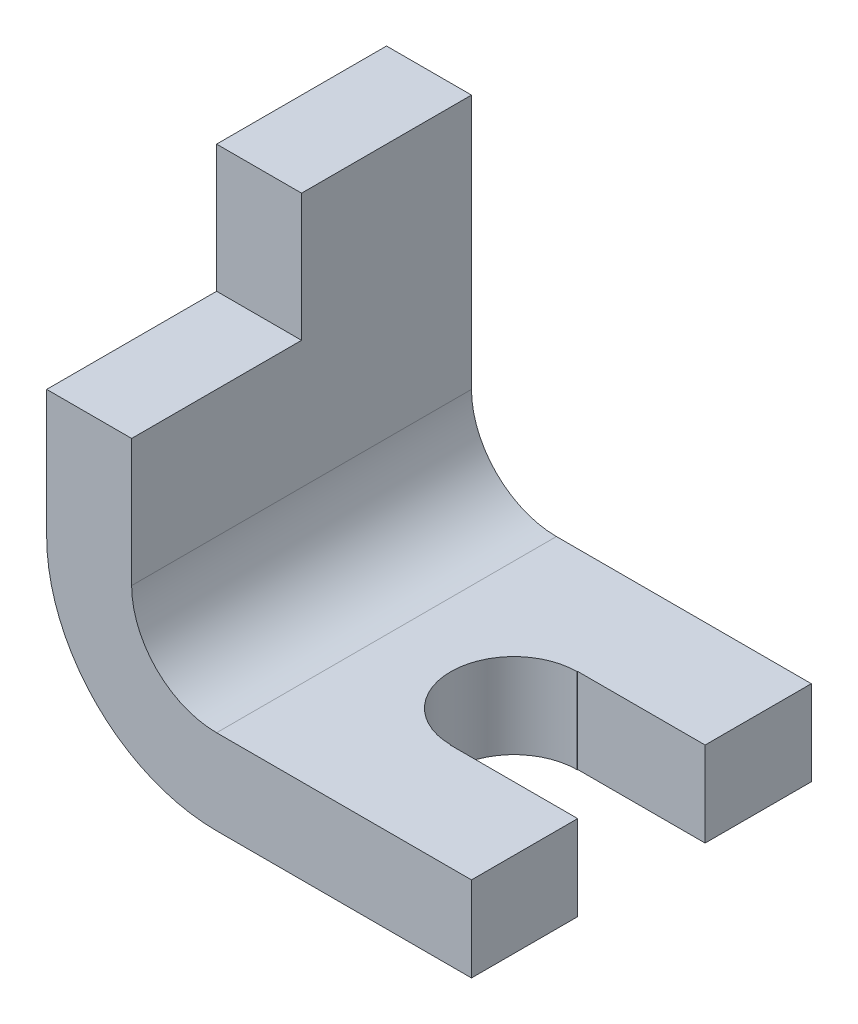
ISO-10303-21;
HEADER;
FILE_DESCRIPTION(('STEP AP214'),'2;1');
FILE_NAME('part.step','',(''),(''),'','','');
FILE_SCHEMA(('AUTOMOTIVE_DESIGN { 1 0 10303 214 1 1 1 1 }'));
ENDSEC;
DATA;
#1=APPLICATION_CONTEXT('core data for automotive mechanical design processes');
#2=APPLICATION_PROTOCOL_DEFINITION('international standard','automotive_design',2000,#1);
#3=PRODUCT_CONTEXT('',#1,'mechanical');
#4=PRODUCT('Part','Part','',(#3));
#5=PRODUCT_RELATED_PRODUCT_CATEGORY('part','',(#4));
#6=PRODUCT_DEFINITION_FORMATION('','',#4);
#7=PRODUCT_DEFINITION_CONTEXT('part definition',#1,'design');
#8=PRODUCT_DEFINITION('design','',#6,#7);
#9=PRODUCT_DEFINITION_SHAPE('','',#8);
#10=(LENGTH_UNIT() NAMED_UNIT(*) SI_UNIT(.MILLI.,.METRE.));
#11=(NAMED_UNIT(*) PLANE_ANGLE_UNIT() SI_UNIT($,.RADIAN.));
#12=(NAMED_UNIT(*) SI_UNIT($,.STERADIAN.) SOLID_ANGLE_UNIT());
#13=UNCERTAINTY_MEASURE_WITH_UNIT(LENGTH_MEASURE(1.E-05),#10,'distance_accuracy_value','');
#14=(GEOMETRIC_REPRESENTATION_CONTEXT(3) GLOBAL_UNCERTAINTY_ASSIGNED_CONTEXT((#13)) GLOBAL_UNIT_ASSIGNED_CONTEXT((#10,
#11,#12)) REPRESENTATION_CONTEXT('',''));
#15=CARTESIAN_POINT('',(0.,0.,0.));
#16=DIRECTION('',(0.,0.,1.));
#17=DIRECTION('',(1.,0.,0.));
#18=AXIS2_PLACEMENT_3D('',#15,#16,#17);
#19=CARTESIAN_POINT('',(50.,10.,-40.));
#20=DIRECTION('',(1.,0.,0.));
#21=DIRECTION('',(0.,0.,-1.));
#22=AXIS2_PLACEMENT_3D('',#19,#20,#21);
#23=PLANE('',#22);
#24=DIRECTION('',(0.,0.,1.));
#25=VECTOR('',#24,1.);
#26=CARTESIAN_POINT('',(50.,10.,-40.));
#27=LINE('',#26,#25);
#28=CARTESIAN_POINT('',(50.,10.,-40.));
#29=VERTEX_POINT('',#28);
#30=CARTESIAN_POINT('',(50.,10.,-27.5));
#31=VERTEX_POINT('',#30);
#32=EDGE_CURVE('E47',#29,#31,#27,.T.);
#33=ORIENTED_EDGE('',*,*,#32,.T.);
#34=DIRECTION('',(0.,-1.,0.));
#35=VECTOR('',#34,1.);
#36=CARTESIAN_POINT('',(50.,124.050480057949,-27.5));
#37=LINE('',#36,#35);
#38=CARTESIAN_POINT('',(50.,0.,-27.5));
#39=VERTEX_POINT('',#38);
#40=EDGE_CURVE('E197',#31,#39,#37,.T.);
#41=ORIENTED_EDGE('',*,*,#40,.T.);
#42=DIRECTION('',(0.,0.,1.));
#43=VECTOR('',#42,1.);
#44=CARTESIAN_POINT('',(50.,0.,-40.));
#45=LINE('',#44,#43);
#46=CARTESIAN_POINT('',(50.,0.,-40.));
#47=VERTEX_POINT('',#46);
#48=EDGE_CURVE('E11',#47,#39,#45,.T.);
#49=ORIENTED_EDGE('',*,*,#48,.F.);
#50=DIRECTION('',(0.,1.,0.));
#51=VECTOR('',#50,1.);
#52=CARTESIAN_POINT('',(50.,10.,-40.));
#53=LINE('',#52,#51);
#54=EDGE_CURVE('E233',#47,#29,#53,.T.);
#55=ORIENTED_EDGE('',*,*,#54,.T.);
#56=EDGE_LOOP('',(#33,#41,#49,#55));
#57=FACE_BOUND('',#56,.T.);
#58=ADVANCED_FACE('F43',(#57),#23,.T.);
#59=CARTESIAN_POINT('',(20.0000000000001,10.,-40.));
#60=DIRECTION('',(0.,1.,0.));
#61=DIRECTION('',(0.,0.,1.));
#62=AXIS2_PLACEMENT_3D('',#59,#60,#61);
#63=PLANE('',#62);
#64=DIRECTION('',(0.,0.,-1.));
#65=VECTOR('',#64,1.);
#66=CARTESIAN_POINT('',(35.,9.99999999999999,-27.4488520760502));
#67=LINE('',#66,#65);
#68=CARTESIAN_POINT('',(35.,9.99999999999999,-27.4488520760502));
#69=VERTEX_POINT('',#68);
#70=CARTESIAN_POINT('',(35.,10.,-27.5));
#71=VERTEX_POINT('',#70);
#72=EDGE_CURVE('E207',#69,#71,#67,.T.);
#73=ORIENTED_EDGE('',*,*,#72,.T.);
#74=DIRECTION('',(1.,0.,0.));
#75=VECTOR('',#74,1.);
#76=CARTESIAN_POINT('',(35.,9.99999999999999,-27.5));
#77=LINE('',#76,#75);
#78=EDGE_CURVE('E204',#71,#31,#77,.T.);
#79=ORIENTED_EDGE('',*,*,#78,.T.);
#80=ORIENTED_EDGE('',*,*,#32,.F.);
#81=DIRECTION('',(-1.,0.,0.));
#82=VECTOR('',#81,1.);
#83=CARTESIAN_POINT('',(20.0000000000001,10.,-40.));
#84=LINE('',#83,#82);
#85=CARTESIAN_POINT('',(20.0000000000001,10.,-40.));
#86=VERTEX_POINT('',#85);
#87=EDGE_CURVE('E237',#29,#86,#84,.T.);
#88=ORIENTED_EDGE('',*,*,#87,.T.);
#89=DIRECTION('',(0.,0.,1.));
#90=VECTOR('',#89,1.);
#91=CARTESIAN_POINT('',(20.0000000000001,10.,-40.));
#92=LINE('',#91,#90);
#93=CARTESIAN_POINT('',(20.0000000000001,10.,0.));
#94=VERTEX_POINT('',#93);
#95=EDGE_CURVE('E308',#86,#94,#92,.T.);
#96=ORIENTED_EDGE('',*,*,#95,.T.);
#97=DIRECTION('',(-1.,0.,0.));
#98=VECTOR('',#97,1.);
#99=CARTESIAN_POINT('',(20.0000000000001,10.,0.));
#100=LINE('',#99,#98);
#101=CARTESIAN_POINT('',(50.,10.,0.));
#102=VERTEX_POINT('',#101);
#103=EDGE_CURVE('E269',#102,#94,#100,.T.);
#104=ORIENTED_EDGE('',*,*,#103,.F.);
#105=CARTESIAN_POINT('',(50.,10.,-12.5));
#106=VERTEX_POINT('',#105);
#107=EDGE_CURVE('E163',#106,#102,#27,.T.);
#108=ORIENTED_EDGE('',*,*,#107,.F.);
#109=DIRECTION('',(-1.,0.,0.));
#110=VECTOR('',#109,1.);
#111=CARTESIAN_POINT('',(35.,9.99999999999999,-12.5));
#112=LINE('',#111,#110);
#113=CARTESIAN_POINT('',(35.,9.99999999999999,-12.5));
#114=VERTEX_POINT('',#113);
#115=EDGE_CURVE('E157',#106,#114,#112,.T.);
#116=ORIENTED_EDGE('',*,*,#115,.T.);
#117=DIRECTION('',(0.,0.,-1.));
#118=VECTOR('',#117,1.);
#119=CARTESIAN_POINT('',(35.,9.99999999999999,-12.5));
#120=LINE('',#119,#118);
#121=CARTESIAN_POINT('',(35.,10.,-12.5511479239498));
#122=VERTEX_POINT('',#121);
#123=EDGE_CURVE('E160',#114,#122,#120,.T.);
#124=ORIENTED_EDGE('',*,*,#123,.T.);
#125=CARTESIAN_POINT('',(35.,9.99999999999999,-20.));
#126=DIRECTION('',(0.,1.,0.));
#127=DIRECTION('',(0.,0.,1.));
#128=AXIS2_PLACEMENT_3D('',#125,#126,#127);
#129=CIRCLE('',#128,7.44885207605021);
#130=EDGE_CURVE('E179',#122,#69,#129,.F.);
#131=ORIENTED_EDGE('',*,*,#130,.T.);
#132=EDGE_LOOP('',(#73,#79,#80,#88,#96,#104,#108,#116,#124,#131));
#133=FACE_BOUND('',#132,.T.);
#134=ADVANCED_FACE('F159',(#133),#63,.T.);
#135=DIRECTION('',(0.,-1.,0.));
#136=VECTOR('',#135,1.);
#137=CARTESIAN_POINT('',(50.,124.050480057949,-12.5));
#138=LINE('',#137,#136);
#139=CARTESIAN_POINT('',(50.,0.,-12.5));
#140=VERTEX_POINT('',#139);
#141=EDGE_CURVE('E185',#106,#140,#138,.T.);
#142=ORIENTED_EDGE('',*,*,#141,.F.);
#143=ORIENTED_EDGE('',*,*,#107,.T.);
#144=DIRECTION('',(0.,1.,0.));
#145=VECTOR('',#144,1.);
#146=CARTESIAN_POINT('',(50.,10.,0.));
#147=LINE('',#146,#145);
#148=CARTESIAN_POINT('',(50.,0.,0.));
#149=VERTEX_POINT('',#148);
#150=EDGE_CURVE('E227',#149,#102,#147,.T.);
#151=ORIENTED_EDGE('',*,*,#150,.F.);
#152=EDGE_CURVE('E53',#140,#149,#45,.T.);
#153=ORIENTED_EDGE('',*,*,#152,.F.);
#154=EDGE_LOOP('',(#142,#143,#151,#153));
#155=FACE_BOUND('',#154,.T.);
#156=ADVANCED_FACE('F45',(#155),#23,.T.);
#157=CARTESIAN_POINT('',(20.,0.,-40.));
#158=DIRECTION('',(0.,-1.,0.));
#159=DIRECTION('',(0.,0.,-1.));
#160=AXIS2_PLACEMENT_3D('',#157,#158,#159);
#161=PLANE('',#160);
#162=DIRECTION('',(1.,0.,0.));
#163=VECTOR('',#162,1.);
#164=CARTESIAN_POINT('',(35.,0.,-27.5));
#165=LINE('',#164,#163);
#166=CARTESIAN_POINT('',(35.,0.,-27.5));
#167=VERTEX_POINT('',#166);
#168=EDGE_CURVE('E60',#167,#39,#165,.T.);
#169=ORIENTED_EDGE('',*,*,#168,.F.);
#170=DIRECTION('',(0.,0.,-1.));
#171=VECTOR('',#170,1.);
#172=CARTESIAN_POINT('',(35.,0.,-27.4488520760502));
#173=LINE('',#172,#171);
#174=CARTESIAN_POINT('',(35.,0.,-27.4488520760502));
#175=VERTEX_POINT('',#174);
#176=EDGE_CURVE('E64',#175,#167,#173,.T.);
#177=ORIENTED_EDGE('',*,*,#176,.F.);
#178=CARTESIAN_POINT('',(35.,0.,-20.));
#179=DIRECTION('',(0.,1.,0.));
#180=DIRECTION('',(0.,0.,1.));
#181=AXIS2_PLACEMENT_3D('',#178,#179,#180);
#182=CIRCLE('',#181,7.44885207605021);
#183=CARTESIAN_POINT('',(35.,0.,-12.5511479239498));
#184=VERTEX_POINT('',#183);
#185=EDGE_CURVE('E329',#184,#175,#182,.F.);
#186=ORIENTED_EDGE('',*,*,#185,.F.);
#187=DIRECTION('',(0.,0.,-1.));
#188=VECTOR('',#187,1.);
#189=CARTESIAN_POINT('',(35.,0.,-12.5));
#190=LINE('',#189,#188);
#191=CARTESIAN_POINT('',(35.,0.,-12.5));
#192=VERTEX_POINT('',#191);
#193=EDGE_CURVE('E325',#192,#184,#190,.T.);
#194=ORIENTED_EDGE('',*,*,#193,.F.);
#195=DIRECTION('',(-1.,0.,0.));
#196=VECTOR('',#195,1.);
#197=CARTESIAN_POINT('',(35.,0.,-12.5));
#198=LINE('',#197,#196);
#199=EDGE_CURVE('E183',#140,#192,#198,.T.);
#200=ORIENTED_EDGE('',*,*,#199,.F.);
#201=ORIENTED_EDGE('',*,*,#152,.T.);
#202=DIRECTION('',(1.,0.,0.));
#203=VECTOR('',#202,1.);
#204=CARTESIAN_POINT('',(20.,0.,0.));
#205=LINE('',#204,#203);
#206=CARTESIAN_POINT('',(20.,0.,0.));
#207=VERTEX_POINT('',#206);
#208=EDGE_CURVE('E238',#207,#149,#205,.T.);
#209=ORIENTED_EDGE('',*,*,#208,.F.);
#210=DIRECTION('',(0.,0.,1.));
#211=VECTOR('',#210,1.);
#212=CARTESIAN_POINT('',(20.,0.,-40.));
#213=LINE('',#212,#211);
#214=CARTESIAN_POINT('',(20.,0.,-40.));
#215=VERTEX_POINT('',#214);
#216=EDGE_CURVE('E291',#215,#207,#213,.T.);
#217=ORIENTED_EDGE('',*,*,#216,.F.);
#218=DIRECTION('',(1.,0.,0.));
#219=VECTOR('',#218,1.);
#220=CARTESIAN_POINT('',(20.,0.,-40.));
#221=LINE('',#220,#219);
#222=EDGE_CURVE('E262',#215,#47,#221,.T.);
#223=ORIENTED_EDGE('',*,*,#222,.T.);
#224=ORIENTED_EDGE('',*,*,#48,.T.);
#225=EDGE_LOOP('',(#169,#177,#186,#194,#200,#201,#209,#217,#223,#224));
#226=FACE_BOUND('',#225,.T.);
#227=ADVANCED_FACE('F323',(#226),#161,.T.);
#228=CARTESIAN_POINT('',(20.,20.,-40.));
#229=DIRECTION('',(0.,0.,1.));
#230=DIRECTION('',(1.,0.,0.));
#231=AXIS2_PLACEMENT_3D('',#228,#229,#230);
#232=CYLINDRICAL_SURFACE('',#231,20.);
#233=CARTESIAN_POINT('',(20.,20.,0.));
#234=DIRECTION('',(0.,0.,1.));
#235=DIRECTION('',(-1.,0.,0.));
#236=AXIS2_PLACEMENT_3D('',#233,#234,#235);
#237=CIRCLE('',#236,20.);
#238=CARTESIAN_POINT('',(0.,20.,0.));
#239=VERTEX_POINT('',#238);
#240=EDGE_CURVE('E284',#239,#207,#237,.T.);
#241=ORIENTED_EDGE('',*,*,#240,.F.);
#242=DIRECTION('',(0.,0.,1.));
#243=VECTOR('',#242,1.);
#244=CARTESIAN_POINT('',(0.,20.,-40.));
#245=LINE('',#244,#243);
#246=CARTESIAN_POINT('',(0.,20.,-40.));
#247=VERTEX_POINT('',#246);
#248=EDGE_CURVE('E294',#247,#239,#245,.T.);
#249=ORIENTED_EDGE('',*,*,#248,.F.);
#250=CARTESIAN_POINT('',(20.,20.,-40.));
#251=DIRECTION('',(0.,0.,1.));
#252=DIRECTION('',(-1.,0.,0.));
#253=AXIS2_PLACEMENT_3D('',#250,#251,#252);
#254=CIRCLE('',#253,20.);
#255=EDGE_CURVE('E258',#247,#215,#254,.T.);
#256=ORIENTED_EDGE('',*,*,#255,.T.);
#257=ORIENTED_EDGE('',*,*,#216,.T.);
#258=EDGE_LOOP('',(#241,#249,#256,#257));
#259=FACE_BOUND('',#258,.T.);
#260=ADVANCED_FACE('F396',(#259),#232,.T.);
#261=CARTESIAN_POINT('',(0.,20.,-40.));
#262=DIRECTION('',(-1.,0.,0.));
#263=DIRECTION('',(0.,0.,1.));
#264=AXIS2_PLACEMENT_3D('',#261,#262,#263);
#265=PLANE('',#264);
#266=DIRECTION('',(0.,1.,0.));
#267=VECTOR('',#266,1.);
#268=CARTESIAN_POINT('',(0.,50.,-20.));
#269=LINE('',#268,#267);
#270=CARTESIAN_POINT('',(0.,35.,-20.));
#271=VERTEX_POINT('',#270);
#272=CARTESIAN_POINT('',(0.,50.,-20.));
#273=VERTEX_POINT('',#272);
#274=EDGE_CURVE('E212',#271,#273,#269,.T.);
#275=ORIENTED_EDGE('',*,*,#274,.T.);
#276=DIRECTION('',(0.,0.,1.));
#277=VECTOR('',#276,1.);
#278=CARTESIAN_POINT('',(0.,50.,-40.));
#279=LINE('',#278,#277);
#280=CARTESIAN_POINT('',(0.,50.,-40.));
#281=VERTEX_POINT('',#280);
#282=EDGE_CURVE('E298',#281,#273,#279,.T.);
#283=ORIENTED_EDGE('',*,*,#282,.F.);
#284=DIRECTION('',(0.,-1.,0.));
#285=VECTOR('',#284,1.);
#286=CARTESIAN_POINT('',(0.,20.,-40.));
#287=LINE('',#286,#285);
#288=EDGE_CURVE('E254',#281,#247,#287,.T.);
#289=ORIENTED_EDGE('',*,*,#288,.T.);
#290=ORIENTED_EDGE('',*,*,#248,.T.);
#291=DIRECTION('',(0.,-1.,0.));
#292=VECTOR('',#291,1.);
#293=CARTESIAN_POINT('',(0.,20.,0.));
#294=LINE('',#293,#292);
#295=CARTESIAN_POINT('',(0.,35.,0.));
#296=VERTEX_POINT('',#295);
#297=EDGE_CURVE('E281',#296,#239,#294,.T.);
#298=ORIENTED_EDGE('',*,*,#297,.F.);
#299=DIRECTION('',(0.,0.,-1.));
#300=VECTOR('',#299,1.);
#301=CARTESIAN_POINT('',(0.,35.,0.));
#302=LINE('',#301,#300);
#303=EDGE_CURVE('E208',#296,#271,#302,.T.);
#304=ORIENTED_EDGE('',*,*,#303,.T.);
#305=EDGE_LOOP('',(#275,#283,#289,#290,#298,#304));
#306=FACE_BOUND('',#305,.T.);
#307=ADVANCED_FACE('F362',(#306),#265,.T.);
#308=CARTESIAN_POINT('',(0.,50.,-40.));
#309=DIRECTION('',(0.,1.,0.));
#310=DIRECTION('',(0.,0.,1.));
#311=AXIS2_PLACEMENT_3D('',#308,#309,#310);
#312=PLANE('',#311);
#313=DIRECTION('',(1.,0.,0.));
#314=VECTOR('',#313,1.);
#315=CARTESIAN_POINT('',(0.,50.,-20.));
#316=LINE('',#315,#314);
#317=CARTESIAN_POINT('',(10.,50.,-20.));
#318=VERTEX_POINT('',#317);
#319=EDGE_CURVE('E223',#273,#318,#316,.T.);
#320=ORIENTED_EDGE('',*,*,#319,.T.);
#321=DIRECTION('',(0.,0.,1.));
#322=VECTOR('',#321,1.);
#323=CARTESIAN_POINT('',(10.,50.,-40.));
#324=LINE('',#323,#322);
#325=CARTESIAN_POINT('',(10.,50.,-40.));
#326=VERTEX_POINT('',#325);
#327=EDGE_CURVE('E302',#326,#318,#324,.T.);
#328=ORIENTED_EDGE('',*,*,#327,.F.);
#329=DIRECTION('',(-1.,0.,0.));
#330=VECTOR('',#329,1.);
#331=CARTESIAN_POINT('',(0.,50.,-40.));
#332=LINE('',#331,#330);
#333=EDGE_CURVE('E250',#326,#281,#332,.T.);
#334=ORIENTED_EDGE('',*,*,#333,.T.);
#335=ORIENTED_EDGE('',*,*,#282,.T.);
#336=EDGE_LOOP('',(#320,#328,#334,#335));
#337=FACE_BOUND('',#336,.T.);
#338=ADVANCED_FACE('F366',(#337),#312,.T.);
#339=CARTESIAN_POINT('',(10.,50.,-40.));
#340=DIRECTION('',(1.,0.,0.));
#341=DIRECTION('',(0.,1.,0.));
#342=AXIS2_PLACEMENT_3D('',#339,#340,#341);
#343=PLANE('',#342);
#344=DIRECTION('',(0.,1.,0.));
#345=VECTOR('',#344,1.);
#346=CARTESIAN_POINT('',(10.,50.,-20.));
#347=LINE('',#346,#345);
#348=CARTESIAN_POINT('',(10.,35.,-20.));
#349=VERTEX_POINT('',#348);
#350=EDGE_CURVE('E213',#349,#318,#347,.T.);
#351=ORIENTED_EDGE('',*,*,#350,.F.);
#352=DIRECTION('',(0.,0.,-1.));
#353=VECTOR('',#352,1.);
#354=CARTESIAN_POINT('',(10.,35.,0.));
#355=LINE('',#354,#353);
#356=CARTESIAN_POINT('',(10.,35.,0.));
#357=VERTEX_POINT('',#356);
#358=EDGE_CURVE('E168',#357,#349,#355,.T.);
#359=ORIENTED_EDGE('',*,*,#358,.F.);
#360=DIRECTION('',(0.,1.,0.));
#361=VECTOR('',#360,1.);
#362=CARTESIAN_POINT('',(10.,50.,0.));
#363=LINE('',#362,#361);
#364=CARTESIAN_POINT('',(10.,20.0000000000001,0.));
#365=VERTEX_POINT('',#364);
#366=EDGE_CURVE('E277',#365,#357,#363,.T.);
#367=ORIENTED_EDGE('',*,*,#366,.F.);
#368=DIRECTION('',(0.,0.,1.));
#369=VECTOR('',#368,1.);
#370=CARTESIAN_POINT('',(10.,20.0000000000001,-40.));
#371=LINE('',#370,#369);
#372=CARTESIAN_POINT('',(10.,20.0000000000001,-40.));
#373=VERTEX_POINT('',#372);
#374=EDGE_CURVE('E306',#373,#365,#371,.T.);
#375=ORIENTED_EDGE('',*,*,#374,.F.);
#376=DIRECTION('',(0.,1.,0.));
#377=VECTOR('',#376,1.);
#378=CARTESIAN_POINT('',(10.,50.,-40.));
#379=LINE('',#378,#377);
#380=EDGE_CURVE('E246',#373,#326,#379,.T.);
#381=ORIENTED_EDGE('',*,*,#380,.T.);
#382=ORIENTED_EDGE('',*,*,#327,.T.);
#383=EDGE_LOOP('',(#351,#359,#367,#375,#381,#382));
#384=FACE_BOUND('',#383,.T.);
#385=ADVANCED_FACE('F369',(#384),#343,.T.);
#386=CARTESIAN_POINT('',(20.,20.,-40.));
#387=DIRECTION('',(0.,0.,1.));
#388=DIRECTION('',(1.,0.,0.));
#389=AXIS2_PLACEMENT_3D('',#386,#387,#388);
#390=CYLINDRICAL_SURFACE('',#389,10.);
#391=CARTESIAN_POINT('',(20.,20.,0.));
#392=DIRECTION('',(0.,0.,-1.));
#393=DIRECTION('',(-1.,0.,0.));
#394=AXIS2_PLACEMENT_3D('',#391,#392,#393);
#395=CIRCLE('',#394,10.);
#396=EDGE_CURVE('E273',#94,#365,#395,.T.);
#397=ORIENTED_EDGE('',*,*,#396,.F.);
#398=ORIENTED_EDGE('',*,*,#95,.F.);
#399=CARTESIAN_POINT('',(20.,20.,-40.));
#400=DIRECTION('',(0.,0.,-1.));
#401=DIRECTION('',(-1.,0.,0.));
#402=AXIS2_PLACEMENT_3D('',#399,#400,#401);
#403=CIRCLE('',#402,10.);
#404=EDGE_CURVE('E242',#86,#373,#403,.T.);
#405=ORIENTED_EDGE('',*,*,#404,.T.);
#406=ORIENTED_EDGE('',*,*,#374,.T.);
#407=EDGE_LOOP('',(#397,#398,#405,#406));
#408=FACE_BOUND('',#407,.T.);
#409=ADVANCED_FACE('F373',(#408),#390,.F.);
#410=CARTESIAN_POINT('',(20.,20.,-40.));
#411=DIRECTION('',(0.,0.,-1.));
#412=DIRECTION('',(-1.,0.,0.));
#413=AXIS2_PLACEMENT_3D('',#410,#411,#412);
#414=PLANE('',#413);
#415=ORIENTED_EDGE('',*,*,#54,.F.);
#416=ORIENTED_EDGE('',*,*,#222,.F.);
#417=ORIENTED_EDGE('',*,*,#255,.F.);
#418=ORIENTED_EDGE('',*,*,#288,.F.);
#419=ORIENTED_EDGE('',*,*,#333,.F.);
#420=ORIENTED_EDGE('',*,*,#380,.F.);
#421=ORIENTED_EDGE('',*,*,#404,.F.);
#422=ORIENTED_EDGE('',*,*,#87,.F.);
#423=EDGE_LOOP('',(#415,#416,#417,#418,#419,#420,#421,#422));
#424=FACE_BOUND('',#423,.T.);
#425=ADVANCED_FACE('F354',(#424),#414,.T.);
#426=CARTESIAN_POINT('',(20.,20.,0.));
#427=DIRECTION('',(0.,0.,-1.));
#428=DIRECTION('',(-1.,0.,0.));
#429=AXIS2_PLACEMENT_3D('',#426,#427,#428);
#430=PLANE('',#429);
#431=ORIENTED_EDGE('',*,*,#366,.T.);
#432=DIRECTION('',(1.,0.,0.));
#433=VECTOR('',#432,1.);
#434=CARTESIAN_POINT('',(0.,35.,0.));
#435=LINE('',#434,#433);
#436=EDGE_CURVE('E217',#296,#357,#435,.T.);
#437=ORIENTED_EDGE('',*,*,#436,.F.);
#438=ORIENTED_EDGE('',*,*,#297,.T.);
#439=ORIENTED_EDGE('',*,*,#240,.T.);
#440=ORIENTED_EDGE('',*,*,#208,.T.);
#441=ORIENTED_EDGE('',*,*,#150,.T.);
#442=ORIENTED_EDGE('',*,*,#103,.T.);
#443=ORIENTED_EDGE('',*,*,#396,.T.);
#444=EDGE_LOOP('',(#431,#437,#438,#439,#440,#441,#442,#443));
#445=FACE_BOUND('',#444,.T.);
#446=ADVANCED_FACE('F320',(#445),#430,.F.);
#447=CARTESIAN_POINT('',(0.,50.,-20.));
#448=DIRECTION('',(0.,0.,-1.));
#449=DIRECTION('',(0.,1.,0.));
#450=AXIS2_PLACEMENT_3D('',#447,#448,#449);
#451=PLANE('',#450);
#452=ORIENTED_EDGE('',*,*,#350,.T.);
#453=ORIENTED_EDGE('',*,*,#319,.F.);
#454=ORIENTED_EDGE('',*,*,#274,.F.);
#455=DIRECTION('',(1.,0.,0.));
#456=VECTOR('',#455,1.);
#457=CARTESIAN_POINT('',(0.,35.,-20.));
#458=LINE('',#457,#456);
#459=EDGE_CURVE('E228',#271,#349,#458,.T.);
#460=ORIENTED_EDGE('',*,*,#459,.T.);
#461=EDGE_LOOP('',(#452,#453,#454,#460));
#462=FACE_BOUND('',#461,.T.);
#463=ADVANCED_FACE('F378',(#462),#451,.F.);
#464=CARTESIAN_POINT('',(0.,35.,0.));
#465=DIRECTION('',(0.,-1.,0.));
#466=DIRECTION('',(1.,0.,0.));
#467=AXIS2_PLACEMENT_3D('',#464,#465,#466);
#468=PLANE('',#467);
#469=ORIENTED_EDGE('',*,*,#358,.T.);
#470=ORIENTED_EDGE('',*,*,#459,.F.);
#471=ORIENTED_EDGE('',*,*,#303,.F.);
#472=ORIENTED_EDGE('',*,*,#436,.T.);
#473=EDGE_LOOP('',(#469,#470,#471,#472));
#474=FACE_BOUND('',#473,.T.);
#475=ADVANCED_FACE('F376',(#474),#468,.F.);
#476=CARTESIAN_POINT('',(35.,124.050480057949,-27.5));
#477=DIRECTION('',(0.,0.,-1.));
#478=DIRECTION('',(-1.,0.,0.));
#479=AXIS2_PLACEMENT_3D('',#476,#477,#478);
#480=PLANE('',#479);
#481=DIRECTION('',(0.,-1.,0.));
#482=VECTOR('',#481,1.);
#483=CARTESIAN_POINT('',(35.,124.050480057949,-27.5));
#484=LINE('',#483,#482);
#485=EDGE_CURVE('E200',#71,#167,#484,.T.);
#486=ORIENTED_EDGE('',*,*,#485,.T.);
#487=ORIENTED_EDGE('',*,*,#168,.T.);
#488=ORIENTED_EDGE('',*,*,#40,.F.);
#489=ORIENTED_EDGE('',*,*,#78,.F.);
#490=EDGE_LOOP('',(#486,#487,#488,#489));
#491=FACE_BOUND('',#490,.T.);
#492=ADVANCED_FACE('F337',(#491),#480,.F.);
#493=CARTESIAN_POINT('',(35.,124.050480057949,-27.4488520760502));
#494=DIRECTION('',(-1.,0.,0.));
#495=DIRECTION('',(0.,0.,1.));
#496=AXIS2_PLACEMENT_3D('',#493,#494,#495);
#497=PLANE('',#496);
#498=DIRECTION('',(0.,-1.,0.));
#499=VECTOR('',#498,1.);
#500=CARTESIAN_POINT('',(35.,124.050480057949,-27.4488520760502));
#501=LINE('',#500,#499);
#502=EDGE_CURVE('E189',#69,#175,#501,.T.);
#503=ORIENTED_EDGE('',*,*,#502,.T.);
#504=ORIENTED_EDGE('',*,*,#176,.T.);
#505=ORIENTED_EDGE('',*,*,#485,.F.);
#506=ORIENTED_EDGE('',*,*,#72,.F.);
#507=EDGE_LOOP('',(#503,#504,#505,#506));
#508=FACE_BOUND('',#507,.T.);
#509=ADVANCED_FACE('F342',(#508),#497,.F.);
#510=CARTESIAN_POINT('',(35.,124.050480057949,-20.));
#511=DIRECTION('',(0.,-1.,0.));
#512=DIRECTION('',(0.,0.,-1.));
#513=AXIS2_PLACEMENT_3D('',#510,#511,#512);
#514=CYLINDRICAL_SURFACE('',#513,7.44885207605021);
#515=DIRECTION('',(0.,-1.,0.));
#516=VECTOR('',#515,1.);
#517=CARTESIAN_POINT('',(35.,124.050480057949,-12.5511479239498));
#518=LINE('',#517,#516);
#519=EDGE_CURVE('E177',#122,#184,#518,.T.);
#520=ORIENTED_EDGE('',*,*,#519,.T.);
#521=ORIENTED_EDGE('',*,*,#185,.T.);
#522=ORIENTED_EDGE('',*,*,#502,.F.);
#523=ORIENTED_EDGE('',*,*,#130,.F.);
#524=EDGE_LOOP('',(#520,#521,#522,#523));
#525=FACE_BOUND('',#524,.T.);
#526=ADVANCED_FACE('F345',(#525),#514,.F.);
#527=CARTESIAN_POINT('',(35.,124.050480057949,-12.5));
#528=DIRECTION('',(-1.,0.,0.));
#529=DIRECTION('',(0.,0.,1.));
#530=AXIS2_PLACEMENT_3D('',#527,#528,#529);
#531=PLANE('',#530);
#532=DIRECTION('',(0.,-1.,0.));
#533=VECTOR('',#532,1.);
#534=CARTESIAN_POINT('',(35.,124.050480057949,-12.5));
#535=LINE('',#534,#533);
#536=EDGE_CURVE('E175',#114,#192,#535,.T.);
#537=ORIENTED_EDGE('',*,*,#536,.T.);
#538=ORIENTED_EDGE('',*,*,#193,.T.);
#539=ORIENTED_EDGE('',*,*,#519,.F.);
#540=ORIENTED_EDGE('',*,*,#123,.F.);
#541=EDGE_LOOP('',(#537,#538,#539,#540));
#542=FACE_BOUND('',#541,.T.);
#543=ADVANCED_FACE('F173',(#542),#531,.F.);
#544=CARTESIAN_POINT('',(35.,124.050480057949,-12.5));
#545=DIRECTION('',(0.,0.,1.));
#546=DIRECTION('',(1.,0.,0.));
#547=AXIS2_PLACEMENT_3D('',#544,#545,#546);
#548=PLANE('',#547);
#549=ORIENTED_EDGE('',*,*,#141,.T.);
#550=ORIENTED_EDGE('',*,*,#199,.T.);
#551=ORIENTED_EDGE('',*,*,#536,.F.);
#552=ORIENTED_EDGE('',*,*,#115,.F.);
#553=EDGE_LOOP('',(#549,#550,#551,#552));
#554=FACE_BOUND('',#553,.T.);
#555=ADVANCED_FACE('F182',(#554),#548,.F.);
#556=CLOSED_SHELL('',(#58,#134,#156,#227,#260,#307,#338,#385,#409,#425,#446,#463,#475,#492,#509,
#526,#543,#555));
#557=MANIFOLD_SOLID_BREP('B2',#556);
#558=ADVANCED_BREP_SHAPE_REPRESENTATION('',(#18,#557),#14);
#559=SHAPE_DEFINITION_REPRESENTATION(#9,#558);
ENDSEC;
END-ISO-10303-21;
